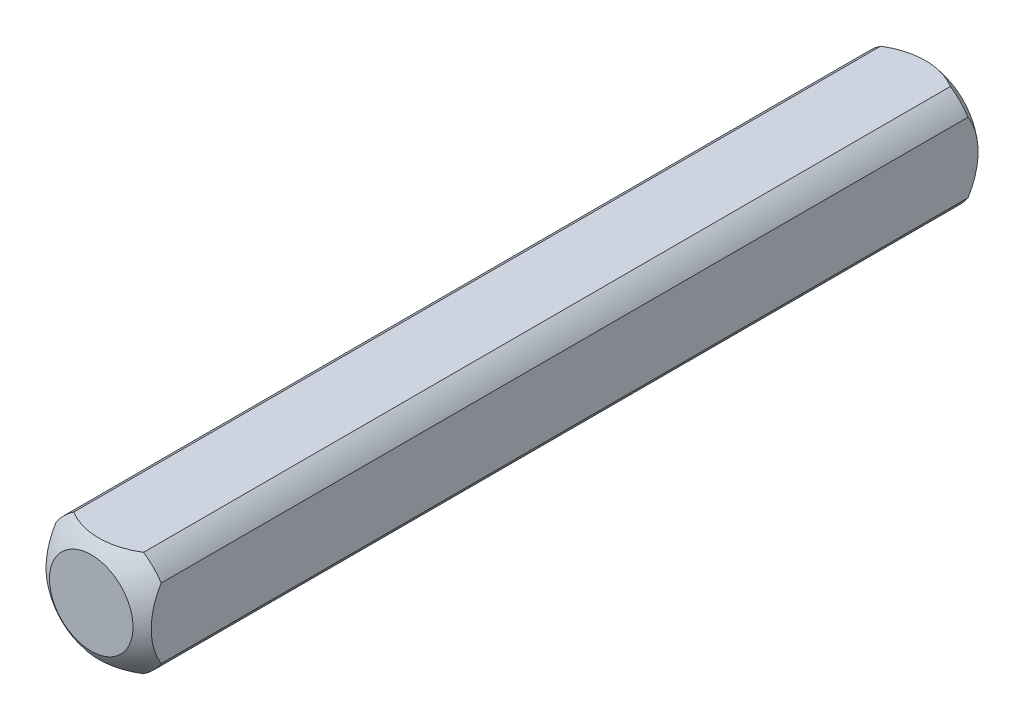
ISO-10303-21;
HEADER;
FILE_DESCRIPTION(('STEP AP214'),'2;1');
FILE_NAME('part.step','',(''),(''),'','','');
FILE_SCHEMA(('AUTOMOTIVE_DESIGN { 1 0 10303 214 1 1 1 1 }'));
ENDSEC;
DATA;
#1=APPLICATION_CONTEXT('core data for automotive mechanical design processes');
#2=APPLICATION_PROTOCOL_DEFINITION('international standard','automotive_design',2000,#1);
#3=PRODUCT_CONTEXT('',#1,'mechanical');
#4=PRODUCT('Part','Part','',(#3));
#5=PRODUCT_RELATED_PRODUCT_CATEGORY('part','',(#4));
#6=PRODUCT_DEFINITION_FORMATION('','',#4);
#7=PRODUCT_DEFINITION_CONTEXT('part definition',#1,'design');
#8=PRODUCT_DEFINITION('design','',#6,#7);
#9=PRODUCT_DEFINITION_SHAPE('','',#8);
#10=(LENGTH_UNIT() NAMED_UNIT(*) SI_UNIT(.MILLI.,.METRE.));
#11=(NAMED_UNIT(*) PLANE_ANGLE_UNIT() SI_UNIT($,.RADIAN.));
#12=(NAMED_UNIT(*) SI_UNIT($,.STERADIAN.) SOLID_ANGLE_UNIT());
#13=UNCERTAINTY_MEASURE_WITH_UNIT(LENGTH_MEASURE(1.E-05),#10,'distance_accuracy_value','');
#14=(GEOMETRIC_REPRESENTATION_CONTEXT(3) GLOBAL_UNCERTAINTY_ASSIGNED_CONTEXT((#13)) GLOBAL_UNIT_ASSIGNED_CONTEXT((#10,
#11,#12)) REPRESENTATION_CONTEXT('',''));
#15=CARTESIAN_POINT('',(0.,0.,0.));
#16=DIRECTION('',(0.,0.,1.));
#17=DIRECTION('',(1.,0.,0.));
#18=AXIS2_PLACEMENT_3D('',#15,#16,#17);
#19=CARTESIAN_POINT('',(-3.175,-3.175,25.4));
#20=DIRECTION('',(1.,0.,0.));
#21=DIRECTION('',(0.,0.,-1.));
#22=AXIS2_PLACEMENT_3D('',#19,#20,#21);
#23=PLANE('',#22);
#24=CARTESIAN_POINT('',(-3.175,0.,4.409725449428));
#25=DIRECTION('',(1.,0.,0.));
#26=DIRECTION('',(0.,0.,-1.));
#27=AXIS2_PLACEMENT_3D('',#24,#25,#26);
#28=CIRCLE('',#27,3.96557372898298);
#29=CARTESIAN_POINT('',(-3.175,-2.10605674187568,1.04962128437597));
#30=VERTEX_POINT('',#29);
#31=CARTESIAN_POINT('',(-3.175,2.10605674187568,1.04962128437597));
#32=VERTEX_POINT('',#31);
#33=EDGE_CURVE('E47',#30,#32,#28,.T.);
#34=ORIENTED_EDGE('',*,*,#33,.F.);
#35=DIRECTION('',(0.,0.,-1.));
#36=VECTOR('',#35,1.);
#37=CARTESIAN_POINT('',(-3.175,-2.10605674187568,25.4));
#38=LINE('',#37,#36);
#39=CARTESIAN_POINT('',(-3.175,-2.10605674187568,49.750378715624));
#40=VERTEX_POINT('',#39);
#41=EDGE_CURVE('E40',#40,#30,#38,.T.);
#42=ORIENTED_EDGE('',*,*,#41,.F.);
#43=CARTESIAN_POINT('',(-3.175,0.,46.390274550572));
#44=DIRECTION('',(-1.,0.,0.));
#45=DIRECTION('',(0.,0.,1.));
#46=AXIS2_PLACEMENT_3D('',#43,#44,#45);
#47=CIRCLE('',#46,3.96557372898298);
#48=CARTESIAN_POINT('',(-3.175,2.10605674187568,49.750378715624));
#49=VERTEX_POINT('',#48);
#50=EDGE_CURVE('E123',#40,#49,#47,.T.);
#51=ORIENTED_EDGE('',*,*,#50,.T.);
#52=DIRECTION('',(0.,0.,-1.));
#53=VECTOR('',#52,1.);
#54=CARTESIAN_POINT('',(-3.175,2.10605674187568,25.4));
#55=LINE('',#54,#53);
#56=EDGE_CURVE('E111',#32,#49,#55,.F.);
#57=ORIENTED_EDGE('',*,*,#56,.F.);
#58=EDGE_LOOP('',(#34,#42,#51,#57));
#59=FACE_BOUND('',#58,.T.);
#60=ADVANCED_FACE('F33',(#59),#23,.F.);
#61=CARTESIAN_POINT('',(-3.175,-3.175,25.4));
#62=DIRECTION('',(0.,1.,0.));
#63=DIRECTION('',(0.,0.,1.));
#64=AXIS2_PLACEMENT_3D('',#61,#62,#63);
#65=PLANE('',#64);
#66=CARTESIAN_POINT('',(0.,-3.175,4.409725449428));
#67=DIRECTION('',(0.,1.,0.));
#68=DIRECTION('',(0.,0.,1.));
#69=AXIS2_PLACEMENT_3D('',#66,#67,#68);
#70=CIRCLE('',#69,3.96557372898298);
#71=CARTESIAN_POINT('',(2.10605674187568,-3.175,1.04962128437597));
#72=VERTEX_POINT('',#71);
#73=CARTESIAN_POINT('',(-2.10605674187568,-3.175,1.04962128437597));
#74=VERTEX_POINT('',#73);
#75=EDGE_CURVE('E152',#72,#74,#70,.T.);
#76=ORIENTED_EDGE('',*,*,#75,.F.);
#77=DIRECTION('',(0.,0.,-1.));
#78=VECTOR('',#77,1.);
#79=CARTESIAN_POINT('',(2.10605674187568,-3.175,25.4));
#80=LINE('',#79,#78);
#81=CARTESIAN_POINT('',(2.10605674187568,-3.175,49.750378715624));
#82=VERTEX_POINT('',#81);
#83=EDGE_CURVE('E165',#82,#72,#80,.T.);
#84=ORIENTED_EDGE('',*,*,#83,.F.);
#85=CARTESIAN_POINT('',(0.,-3.175,46.390274550572));
#86=DIRECTION('',(0.,-1.,0.));
#87=DIRECTION('',(0.,0.,-1.));
#88=AXIS2_PLACEMENT_3D('',#85,#86,#87);
#89=CIRCLE('',#88,3.96557372898298);
#90=CARTESIAN_POINT('',(-2.10605674187568,-3.175,49.750378715624));
#91=VERTEX_POINT('',#90);
#92=EDGE_CURVE('E134',#82,#91,#89,.T.);
#93=ORIENTED_EDGE('',*,*,#92,.T.);
#94=DIRECTION('',(0.,0.,-1.));
#95=VECTOR('',#94,1.);
#96=CARTESIAN_POINT('',(-2.10605674187568,-3.175,25.4));
#97=LINE('',#96,#95);
#98=EDGE_CURVE('E163',#74,#91,#97,.F.);
#99=ORIENTED_EDGE('',*,*,#98,.F.);
#100=EDGE_LOOP('',(#76,#84,#93,#99));
#101=FACE_BOUND('',#100,.T.);
#102=ADVANCED_FACE('F175',(#101),#65,.F.);
#103=CARTESIAN_POINT('',(3.175,-3.175,25.4));
#104=DIRECTION('',(-1.,0.,0.));
#105=DIRECTION('',(0.,0.,1.));
#106=AXIS2_PLACEMENT_3D('',#103,#104,#105);
#107=PLANE('',#106);
#108=CARTESIAN_POINT('',(3.175,0.,4.409725449428));
#109=DIRECTION('',(-1.,0.,0.));
#110=DIRECTION('',(0.,0.,1.));
#111=AXIS2_PLACEMENT_3D('',#108,#109,#110);
#112=CIRCLE('',#111,3.96557372898298);
#113=CARTESIAN_POINT('',(3.175,2.10605674187568,1.04962128437597));
#114=VERTEX_POINT('',#113);
#115=CARTESIAN_POINT('',(3.175,-2.10605674187568,1.04962128437597));
#116=VERTEX_POINT('',#115);
#117=EDGE_CURVE('E150',#114,#116,#112,.T.);
#118=ORIENTED_EDGE('',*,*,#117,.F.);
#119=DIRECTION('',(0.,0.,-1.));
#120=VECTOR('',#119,1.);
#121=CARTESIAN_POINT('',(3.175,2.10605674187568,25.4));
#122=LINE('',#121,#120);
#123=CARTESIAN_POINT('',(3.175,2.10605674187568,49.750378715624));
#124=VERTEX_POINT('',#123);
#125=EDGE_CURVE('E160',#124,#114,#122,.T.);
#126=ORIENTED_EDGE('',*,*,#125,.F.);
#127=CARTESIAN_POINT('',(3.175,0.,46.390274550572));
#128=DIRECTION('',(1.,0.,0.));
#129=DIRECTION('',(0.,0.,-1.));
#130=AXIS2_PLACEMENT_3D('',#127,#128,#129);
#131=CIRCLE('',#130,3.96557372898298);
#132=CARTESIAN_POINT('',(3.175,-2.10605674187568,49.750378715624));
#133=VERTEX_POINT('',#132);
#134=EDGE_CURVE('E131',#124,#133,#131,.T.);
#135=ORIENTED_EDGE('',*,*,#134,.T.);
#136=DIRECTION('',(0.,0.,-1.));
#137=VECTOR('',#136,1.);
#138=CARTESIAN_POINT('',(3.175,-2.10605674187568,25.4));
#139=LINE('',#138,#137);
#140=EDGE_CURVE('E104',#116,#133,#139,.F.);
#141=ORIENTED_EDGE('',*,*,#140,.F.);
#142=EDGE_LOOP('',(#118,#126,#135,#141));
#143=FACE_BOUND('',#142,.T.);
#144=ADVANCED_FACE('F182',(#143),#107,.F.);
#145=CARTESIAN_POINT('',(-3.175,3.175,25.4));
#146=DIRECTION('',(0.,-1.,0.));
#147=DIRECTION('',(0.,0.,-1.));
#148=AXIS2_PLACEMENT_3D('',#145,#146,#147);
#149=PLANE('',#148);
#150=CARTESIAN_POINT('',(0.,3.175,4.409725449428));
#151=DIRECTION('',(0.,-1.,0.));
#152=DIRECTION('',(0.,0.,-1.));
#153=AXIS2_PLACEMENT_3D('',#150,#151,#152);
#154=CIRCLE('',#153,3.96557372898298);
#155=CARTESIAN_POINT('',(-2.10605674187568,3.175,1.04962128437597));
#156=VERTEX_POINT('',#155);
#157=CARTESIAN_POINT('',(2.10605674187568,3.175,1.04962128437597));
#158=VERTEX_POINT('',#157);
#159=EDGE_CURVE('E102',#156,#158,#154,.T.);
#160=ORIENTED_EDGE('',*,*,#159,.F.);
#161=DIRECTION('',(0.,0.,-1.));
#162=VECTOR('',#161,1.);
#163=CARTESIAN_POINT('',(-2.10605674187568,3.175,25.4));
#164=LINE('',#163,#162);
#165=CARTESIAN_POINT('',(-2.10605674187568,3.175,49.750378715624));
#166=VERTEX_POINT('',#165);
#167=EDGE_CURVE('E96',#166,#156,#164,.T.);
#168=ORIENTED_EDGE('',*,*,#167,.F.);
#169=CARTESIAN_POINT('',(0.,3.175,46.390274550572));
#170=DIRECTION('',(0.,1.,0.));
#171=DIRECTION('',(0.,0.,1.));
#172=AXIS2_PLACEMENT_3D('',#169,#170,#171);
#173=CIRCLE('',#172,3.96557372898298);
#174=CARTESIAN_POINT('',(2.10605674187568,3.175,49.750378715624));
#175=VERTEX_POINT('',#174);
#176=EDGE_CURVE('E101',#166,#175,#173,.T.);
#177=ORIENTED_EDGE('',*,*,#176,.T.);
#178=DIRECTION('',(0.,0.,-1.));
#179=VECTOR('',#178,1.);
#180=CARTESIAN_POINT('',(2.10605674187568,3.175,25.4));
#181=LINE('',#180,#179);
#182=EDGE_CURVE('E105',#158,#175,#181,.F.);
#183=ORIENTED_EDGE('',*,*,#182,.F.);
#184=EDGE_LOOP('',(#160,#168,#177,#183));
#185=FACE_BOUND('',#184,.T.);
#186=ADVANCED_FACE('F98',(#185),#149,.F.);
#187=CARTESIAN_POINT('',(0.,0.,25.4));
#188=DIRECTION('',(0.,0.,-1.));
#189=DIRECTION('',(-1.,0.,0.));
#190=AXIS2_PLACEMENT_3D('',#187,#188,#189);
#191=CYLINDRICAL_SURFACE('',#190,3.81);
#192=ORIENTED_EDGE('',*,*,#41,.T.);
#193=CARTESIAN_POINT('',(0.,0.,1.04962128437597));
#194=DIRECTION('',(0.,0.,1.));
#195=DIRECTION('',(1.,0.,0.));
#196=AXIS2_PLACEMENT_3D('',#193,#194,#195);
#197=CIRCLE('',#196,3.81);
#198=EDGE_CURVE('E147',#30,#74,#197,.T.);
#199=ORIENTED_EDGE('',*,*,#198,.T.);
#200=ORIENTED_EDGE('',*,*,#98,.T.);
#201=CARTESIAN_POINT('',(0.,0.,49.750378715624));
#202=DIRECTION('',(0.,0.,1.));
#203=DIRECTION('',(1.,0.,0.));
#204=AXIS2_PLACEMENT_3D('',#201,#202,#203);
#205=CIRCLE('',#204,3.81);
#206=EDGE_CURVE('E128',#40,#91,#205,.T.);
#207=ORIENTED_EDGE('',*,*,#206,.F.);
#208=EDGE_LOOP('',(#192,#199,#200,#207));
#209=FACE_BOUND('',#208,.T.);
#210=ADVANCED_FACE('F171',(#209),#191,.T.);
#211=ORIENTED_EDGE('',*,*,#83,.T.);
#212=CARTESIAN_POINT('',(0.,0.,1.04962128437597));
#213=DIRECTION('',(0.,0.,1.));
#214=DIRECTION('',(1.,0.,0.));
#215=AXIS2_PLACEMENT_3D('',#212,#213,#214);
#216=CIRCLE('',#215,3.81);
#217=EDGE_CURVE('E53',#72,#116,#216,.T.);
#218=ORIENTED_EDGE('',*,*,#217,.T.);
#219=ORIENTED_EDGE('',*,*,#140,.T.);
#220=CARTESIAN_POINT('',(0.,0.,49.750378715624));
#221=DIRECTION('',(0.,0.,1.));
#222=DIRECTION('',(1.,0.,0.));
#223=AXIS2_PLACEMENT_3D('',#220,#221,#222);
#224=CIRCLE('',#223,3.81);
#225=EDGE_CURVE('E137',#82,#133,#224,.T.);
#226=ORIENTED_EDGE('',*,*,#225,.F.);
#227=EDGE_LOOP('',(#211,#218,#219,#226));
#228=FACE_BOUND('',#227,.T.);
#229=ADVANCED_FACE('F178',(#228),#191,.T.);
#230=ORIENTED_EDGE('',*,*,#125,.T.);
#231=CARTESIAN_POINT('',(0.,0.,1.04962128437597));
#232=DIRECTION('',(0.,0.,1.));
#233=DIRECTION('',(1.,0.,0.));
#234=AXIS2_PLACEMENT_3D('',#231,#232,#233);
#235=CIRCLE('',#234,3.81);
#236=EDGE_CURVE('E144',#114,#158,#235,.T.);
#237=ORIENTED_EDGE('',*,*,#236,.T.);
#238=ORIENTED_EDGE('',*,*,#182,.T.);
#239=CARTESIAN_POINT('',(0.,0.,49.750378715624));
#240=DIRECTION('',(0.,0.,1.));
#241=DIRECTION('',(1.,0.,0.));
#242=AXIS2_PLACEMENT_3D('',#239,#240,#241);
#243=CIRCLE('',#242,3.81);
#244=EDGE_CURVE('E122',#124,#175,#243,.T.);
#245=ORIENTED_EDGE('',*,*,#244,.F.);
#246=EDGE_LOOP('',(#230,#237,#238,#245));
#247=FACE_BOUND('',#246,.T.);
#248=ADVANCED_FACE('F184',(#247),#191,.T.);
#249=ORIENTED_EDGE('',*,*,#167,.T.);
#250=CARTESIAN_POINT('',(0.,0.,1.04962128437597));
#251=DIRECTION('',(0.,0.,1.));
#252=DIRECTION('',(1.,0.,0.));
#253=AXIS2_PLACEMENT_3D('',#250,#251,#252);
#254=CIRCLE('',#253,3.81);
#255=EDGE_CURVE('E12',#156,#32,#254,.T.);
#256=ORIENTED_EDGE('',*,*,#255,.T.);
#257=ORIENTED_EDGE('',*,*,#56,.T.);
#258=CARTESIAN_POINT('',(0.,0.,49.750378715624));
#259=DIRECTION('',(0.,0.,1.));
#260=DIRECTION('',(1.,0.,0.));
#261=AXIS2_PLACEMENT_3D('',#258,#259,#260);
#262=CIRCLE('',#261,3.81);
#263=EDGE_CURVE('E108',#166,#49,#262,.T.);
#264=ORIENTED_EDGE('',*,*,#263,.F.);
#265=EDGE_LOOP('',(#249,#256,#257,#264));
#266=FACE_BOUND('',#265,.T.);
#267=ADVANCED_FACE('F109',(#266),#191,.T.);
#268=CARTESIAN_POINT('',(0.,0.,4.409725449428));
#269=DIRECTION('',(0.,0.,1.));
#270=DIRECTION('',(-1.,0.,0.));
#271=AXIS2_PLACEMENT_3D('',#268,#269,#270);
#272=SPHERICAL_SURFACE('',#271,5.08);
#273=CARTESIAN_POINT('',(0.,0.,0.));
#274=DIRECTION('',(0.,0.,-1.));
#275=DIRECTION('',(-1.,0.,0.));
#276=AXIS2_PLACEMENT_3D('',#273,#274,#275);
#277=CIRCLE('',#276,2.52204707740896);
#278=CARTESIAN_POINT('',(-2.52204707740896,0.,0.));
#279=VERTEX_POINT('',#278);
#280=EDGE_CURVE('E155',#279,#279,#277,.T.);
#281=ORIENTED_EDGE('',*,*,#280,.F.);
#282=EDGE_LOOP('',(#281));
#283=FACE_BOUND('',#282,.T.);
#284=ORIENTED_EDGE('',*,*,#75,.T.);
#285=ORIENTED_EDGE('',*,*,#198,.F.);
#286=ORIENTED_EDGE('',*,*,#33,.T.);
#287=ORIENTED_EDGE('',*,*,#255,.F.);
#288=ORIENTED_EDGE('',*,*,#159,.T.);
#289=ORIENTED_EDGE('',*,*,#236,.F.);
#290=ORIENTED_EDGE('',*,*,#117,.T.);
#291=ORIENTED_EDGE('',*,*,#217,.F.);
#292=EDGE_LOOP('',(#284,#285,#286,#287,#288,#289,#290,#291));
#293=FACE_BOUND('',#292,.T.);
#294=ADVANCED_FACE('F185',(#283,#293),#272,.T.);
#295=CARTESIAN_POINT('',(0.,0.,0.));
#296=DIRECTION('',(0.,0.,-1.));
#297=DIRECTION('',(-1.,0.,0.));
#298=AXIS2_PLACEMENT_3D('',#295,#296,#297);
#299=PLANE('',#298);
#300=ORIENTED_EDGE('',*,*,#280,.T.);
#301=EDGE_LOOP('',(#300));
#302=FACE_BOUND('',#301,.T.);
#303=ADVANCED_FACE('F187',(#302),#299,.T.);
#304=CARTESIAN_POINT('',(0.,0.,46.390274550572));
#305=DIRECTION('',(0.,0.,-1.));
#306=DIRECTION('',(-1.,0.,0.));
#307=AXIS2_PLACEMENT_3D('',#304,#305,#306);
#308=SPHERICAL_SURFACE('',#307,5.08);
#309=CARTESIAN_POINT('',(0.,0.,50.8));
#310=DIRECTION('',(0.,0.,-1.));
#311=DIRECTION('',(-1.,0.,0.));
#312=AXIS2_PLACEMENT_3D('',#309,#310,#311);
#313=CIRCLE('',#312,2.52204707740896);
#314=CARTESIAN_POINT('',(-2.52204707740896,0.,50.8));
#315=VERTEX_POINT('',#314);
#316=EDGE_CURVE('E115',#315,#315,#313,.T.);
#317=ORIENTED_EDGE('',*,*,#316,.T.);
#318=EDGE_LOOP('',(#317));
#319=FACE_BOUND('',#318,.T.);
#320=ORIENTED_EDGE('',*,*,#92,.F.);
#321=ORIENTED_EDGE('',*,*,#225,.T.);
#322=ORIENTED_EDGE('',*,*,#134,.F.);
#323=ORIENTED_EDGE('',*,*,#244,.T.);
#324=ORIENTED_EDGE('',*,*,#176,.F.);
#325=ORIENTED_EDGE('',*,*,#263,.T.);
#326=ORIENTED_EDGE('',*,*,#50,.F.);
#327=ORIENTED_EDGE('',*,*,#206,.T.);
#328=EDGE_LOOP('',(#320,#321,#322,#323,#324,#325,#326,#327));
#329=FACE_BOUND('',#328,.T.);
#330=ADVANCED_FACE('F119',(#319,#329),#308,.T.);
#331=CARTESIAN_POINT('',(0.,0.,50.8));
#332=DIRECTION('',(0.,0.,1.));
#333=DIRECTION('',(-1.,0.,0.));
#334=AXIS2_PLACEMENT_3D('',#331,#332,#333);
#335=PLANE('',#334);
#336=ORIENTED_EDGE('',*,*,#316,.F.);
#337=EDGE_LOOP('',(#336));
#338=FACE_BOUND('',#337,.T.);
#339=ADVANCED_FACE('F232',(#338),#335,.T.);
#340=CLOSED_SHELL('',(#60,#102,#144,#186,#210,#229,#248,#267,#294,#303,#330,#339));
#341=MANIFOLD_SOLID_BREP('B2',#340);
#342=ADVANCED_BREP_SHAPE_REPRESENTATION('',(#18,#341),#14);
#343=SHAPE_DEFINITION_REPRESENTATION(#9,#342);
ENDSEC;
END-ISO-10303-21;
